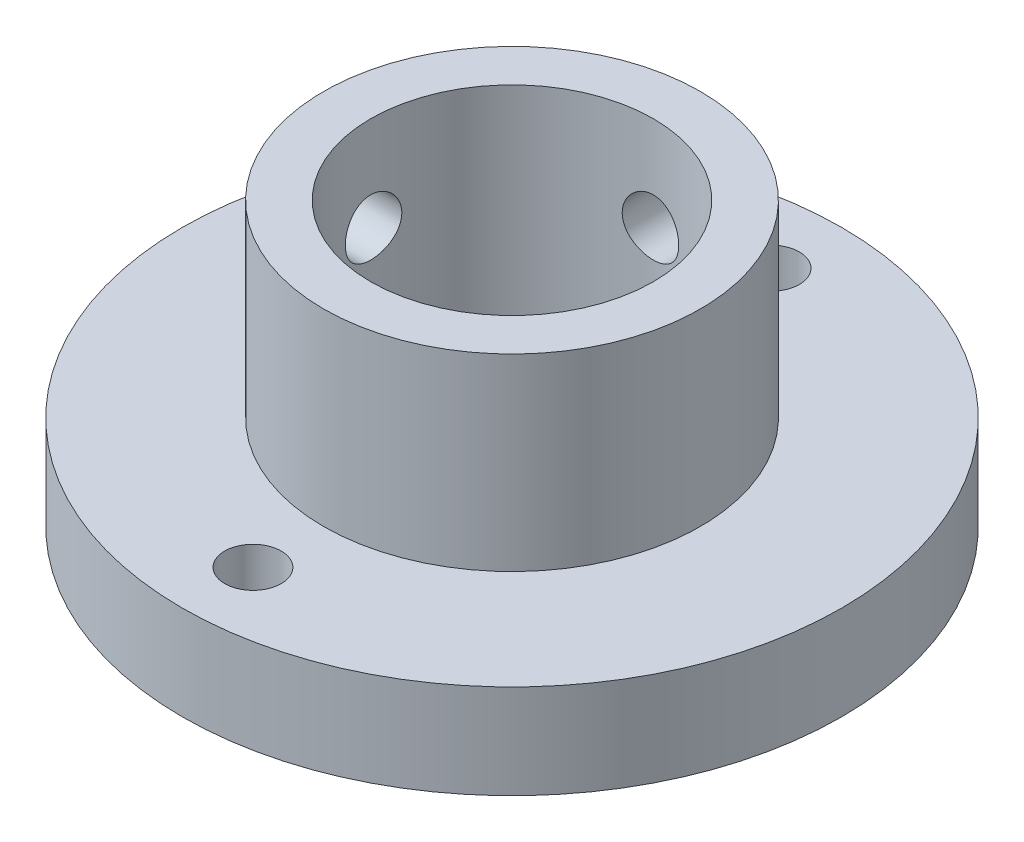
ISO-10303-21;
HEADER;
FILE_DESCRIPTION(('STEP AP214'),'2;1');
FILE_NAME('part.step','',(''),(''),'','','');
FILE_SCHEMA(('AUTOMOTIVE_DESIGN { 1 0 10303 214 1 1 1 1 }'));
ENDSEC;
DATA;
#1=APPLICATION_CONTEXT('core data for automotive mechanical design processes');
#2=APPLICATION_PROTOCOL_DEFINITION('international standard','automotive_design',2000,#1);
#3=PRODUCT_CONTEXT('',#1,'mechanical');
#4=PRODUCT('Part','Part','',(#3));
#5=PRODUCT_RELATED_PRODUCT_CATEGORY('part','',(#4));
#6=PRODUCT_DEFINITION_FORMATION('','',#4);
#7=PRODUCT_DEFINITION_CONTEXT('part definition',#1,'design');
#8=PRODUCT_DEFINITION('design','',#6,#7);
#9=PRODUCT_DEFINITION_SHAPE('','',#8);
#10=(LENGTH_UNIT() NAMED_UNIT(*) SI_UNIT(.MILLI.,.METRE.));
#11=(NAMED_UNIT(*) PLANE_ANGLE_UNIT() SI_UNIT($,.RADIAN.));
#12=(NAMED_UNIT(*) SI_UNIT($,.STERADIAN.) SOLID_ANGLE_UNIT());
#13=UNCERTAINTY_MEASURE_WITH_UNIT(LENGTH_MEASURE(1.E-05),#10,'distance_accuracy_value','');
#14=(GEOMETRIC_REPRESENTATION_CONTEXT(3) GLOBAL_UNCERTAINTY_ASSIGNED_CONTEXT((#13)) GLOBAL_UNIT_ASSIGNED_CONTEXT((#10,
#11,#12)) REPRESENTATION_CONTEXT('',''));
#15=CARTESIAN_POINT('',(0.,0.,0.));
#16=DIRECTION('',(0.,0.,1.));
#17=DIRECTION('',(1.,0.,0.));
#18=AXIS2_PLACEMENT_3D('',#15,#16,#17);
#19=CARTESIAN_POINT('',(0.,5.,0.));
#20=DIRECTION('',(0.,-1.,0.));
#21=DIRECTION('',(0.,0.,-1.));
#22=AXIS2_PLACEMENT_3D('',#19,#20,#21);
#23=CYLINDRICAL_SURFACE('',#22,17.5);
#24=CARTESIAN_POINT('',(0.,5.,0.));
#25=DIRECTION('',(0.,1.,0.));
#26=DIRECTION('',(0.,0.,1.));
#27=AXIS2_PLACEMENT_3D('',#24,#25,#26);
#28=CIRCLE('',#27,17.5);
#29=CARTESIAN_POINT('',(0.,5.,17.5));
#30=VERTEX_POINT('',#29);
#31=EDGE_CURVE('E52',#30,#30,#28,.T.);
#32=ORIENTED_EDGE('',*,*,#31,.F.);
#33=EDGE_LOOP('',(#32));
#34=FACE_BOUND('',#33,.T.);
#35=CARTESIAN_POINT('',(0.,0.,0.));
#36=DIRECTION('',(0.,1.,0.));
#37=DIRECTION('',(0.,0.,1.));
#38=AXIS2_PLACEMENT_3D('',#35,#36,#37);
#39=CIRCLE('',#38,17.5);
#40=CARTESIAN_POINT('',(0.,0.,17.5));
#41=VERTEX_POINT('',#40);
#42=EDGE_CURVE('E58',#41,#41,#39,.T.);
#43=ORIENTED_EDGE('',*,*,#42,.T.);
#44=EDGE_LOOP('',(#43));
#45=FACE_BOUND('',#44,.T.);
#46=ADVANCED_FACE('F39',(#34,#45),#23,.T.);
#47=CARTESIAN_POINT('',(0.,5.,0.));
#48=DIRECTION('',(0.,1.,0.));
#49=DIRECTION('',(0.,0.,1.));
#50=AXIS2_PLACEMENT_3D('',#47,#48,#49);
#51=PLANE('',#50);
#52=CARTESIAN_POINT('',(0.,5.,-13.75));
#53=DIRECTION('',(0.,1.,0.));
#54=DIRECTION('',(0.,0.,1.));
#55=AXIS2_PLACEMENT_3D('',#52,#53,#54);
#56=CIRCLE('',#55,1.5);
#57=CARTESIAN_POINT('',(0.,5.,-12.25));
#58=VERTEX_POINT('',#57);
#59=EDGE_CURVE('E72',#58,#58,#56,.T.);
#60=ORIENTED_EDGE('',*,*,#59,.F.);
#61=EDGE_LOOP('',(#60));
#62=FACE_BOUND('',#61,.T.);
#63=CARTESIAN_POINT('',(0.,5.,13.75));
#64=DIRECTION('',(0.,1.,0.));
#65=DIRECTION('',(0.,0.,1.));
#66=AXIS2_PLACEMENT_3D('',#63,#64,#65);
#67=CIRCLE('',#66,1.5);
#68=CARTESIAN_POINT('',(0.,5.,15.25));
#69=VERTEX_POINT('',#68);
#70=EDGE_CURVE('E107',#69,#69,#67,.T.);
#71=ORIENTED_EDGE('',*,*,#70,.F.);
#72=EDGE_LOOP('',(#71));
#73=FACE_BOUND('',#72,.T.);
#74=CARTESIAN_POINT('',(0.,5.,0.));
#75=DIRECTION('',(0.,1.,0.));
#76=DIRECTION('',(0.,0.,1.));
#77=AXIS2_PLACEMENT_3D('',#74,#75,#76);
#78=CIRCLE('',#77,10.);
#79=CARTESIAN_POINT('',(0.,5.,10.));
#80=VERTEX_POINT('',#79);
#81=EDGE_CURVE('E10',#80,#80,#78,.T.);
#82=ORIENTED_EDGE('',*,*,#81,.F.);
#83=EDGE_LOOP('',(#82));
#84=FACE_BOUND('',#83,.T.);
#85=ORIENTED_EDGE('',*,*,#31,.T.);
#86=EDGE_LOOP('',(#85));
#87=FACE_BOUND('',#86,.T.);
#88=ADVANCED_FACE('F119',(#62,#73,#84,#87),#51,.T.);
#89=CARTESIAN_POINT('',(0.,0.,0.));
#90=DIRECTION('',(0.,1.,0.));
#91=DIRECTION('',(0.,0.,1.));
#92=AXIS2_PLACEMENT_3D('',#89,#90,#91);
#93=PLANE('',#92);
#94=CARTESIAN_POINT('',(0.,0.,-13.75));
#95=DIRECTION('',(0.,1.,0.));
#96=DIRECTION('',(0.,0.,1.));
#97=AXIS2_PLACEMENT_3D('',#94,#95,#96);
#98=CIRCLE('',#97,1.5);
#99=CARTESIAN_POINT('',(0.,0.,-12.25));
#100=VERTEX_POINT('',#99);
#101=EDGE_CURVE('E71',#100,#100,#98,.T.);
#102=ORIENTED_EDGE('',*,*,#101,.T.);
#103=EDGE_LOOP('',(#102));
#104=FACE_BOUND('',#103,.T.);
#105=CARTESIAN_POINT('',(0.,0.,13.75));
#106=DIRECTION('',(0.,1.,0.));
#107=DIRECTION('',(0.,0.,1.));
#108=AXIS2_PLACEMENT_3D('',#105,#106,#107);
#109=CIRCLE('',#108,1.5);
#110=CARTESIAN_POINT('',(0.,0.,15.25));
#111=VERTEX_POINT('',#110);
#112=EDGE_CURVE('E67',#111,#111,#109,.T.);
#113=ORIENTED_EDGE('',*,*,#112,.T.);
#114=EDGE_LOOP('',(#113));
#115=FACE_BOUND('',#114,.T.);
#116=CARTESIAN_POINT('',(0.,0.,0.));
#117=DIRECTION('',(0.,1.,0.));
#118=DIRECTION('',(0.,0.,1.));
#119=AXIS2_PLACEMENT_3D('',#116,#117,#118);
#120=CIRCLE('',#119,7.5);
#121=CARTESIAN_POINT('',(0.,0.,7.5));
#122=VERTEX_POINT('',#121);
#123=EDGE_CURVE('E212',#122,#122,#120,.T.);
#124=ORIENTED_EDGE('',*,*,#123,.T.);
#125=EDGE_LOOP('',(#124));
#126=FACE_BOUND('',#125,.T.);
#127=ORIENTED_EDGE('',*,*,#42,.F.);
#128=EDGE_LOOP('',(#127));
#129=FACE_BOUND('',#128,.T.);
#130=ADVANCED_FACE('F117',(#104,#115,#126,#129),#93,.F.);
#131=CARTESIAN_POINT('',(0.,15.,0.));
#132=DIRECTION('',(0.,-1.,0.));
#133=DIRECTION('',(0.,0.,-1.));
#134=AXIS2_PLACEMENT_3D('',#131,#132,#133);
#135=CYLINDRICAL_SURFACE('',#134,10.);
#136=CARTESIAN_POINT('',(-10.,8.5,0.));
#137=CARTESIAN_POINT('',(-9.99999865771297,8.50000345381524,-0.083751544481642));
#138=CARTESIAN_POINT('',(-9.9989368253704,8.50703800084064,-0.167551685082131));
#139=CARTESIAN_POINT('',(-9.99480315973187,8.53498319998275,-0.332809627994913));
#140=CARTESIAN_POINT('',(-9.99172936938473,8.5559073629449,-0.414265068974229));
#141=CARTESIAN_POINT('',(-9.98391721219526,8.61099250496762,-0.57241808622186));
#142=CARTESIAN_POINT('',(-9.97918010370919,8.64514347950595,-0.649119207826798));
#143=CARTESIAN_POINT('',(-9.96856475911724,8.72568837941686,-0.795690428635253));
#144=CARTESIAN_POINT('',(-9.96268668152773,8.77208060441736,-0.865561474725188));
#145=CARTESIAN_POINT('',(-9.95039170991452,8.87617726493988,-0.997046719562125));
#146=CARTESIAN_POINT('',(-9.94397133890331,8.93395845620821,-1.0585998322255));
#147=CARTESIAN_POINT('',(-9.93134261133238,9.05902768889387,-1.17117490668948));
#148=CARTESIAN_POINT('',(-9.92513426698505,9.12631627677852,-1.22219626272936));
#149=CARTESIAN_POINT('',(-9.91359877458726,9.26890064352249,-1.31249729499943));
#150=CARTESIAN_POINT('',(-9.90827611975031,9.34423424698134,-1.35171787037205));
#151=CARTESIAN_POINT('',(-9.89916211306268,9.50051282064543,-1.41692632171056));
#152=CARTESIAN_POINT('',(-9.89537067775449,9.58145748474389,-1.44291491889163));
#153=CARTESIAN_POINT('',(-9.88978256218673,9.74601804187172,-1.48073198798911));
#154=CARTESIAN_POINT('',(-9.8879711574125,9.82960939340802,-1.49266503640518));
#155=CARTESIAN_POINT('',(-9.88650348970582,9.99762616598728,-1.50235624033932));
#156=CARTESIAN_POINT('',(-9.88684710303147,10.0820515388625,-1.50011520973796));
#157=CARTESIAN_POINT('',(-9.88963718352409,10.2486010801941,-1.48160733250788));
#158=CARTESIAN_POINT('',(-9.89206618761549,10.3307385264848,-1.4654569592775));
#159=CARTESIAN_POINT('',(-9.89872608126367,10.4911243688715,-1.41977117403734));
#160=CARTESIAN_POINT('',(-9.90295702179379,10.5693726548807,-1.39023538337812));
#161=CARTESIAN_POINT('',(-9.91276335545481,10.7201133712829,-1.31849603529736));
#162=CARTESIAN_POINT('',(-9.91834396766526,10.7925819690924,-1.27624314283198));
#163=CARTESIAN_POINT('',(-9.93021707574548,10.9294445957819,-1.18030413128955));
#164=CARTESIAN_POINT('',(-9.93650961832501,10.9938380942694,-1.12661726182478));
#165=CARTESIAN_POINT('',(-9.94917473056209,11.1133976607397,-1.00869493078248));
#166=CARTESIAN_POINT('',(-9.95554747112815,11.1684649902863,-0.944359329642002));
#167=CARTESIAN_POINT('',(-9.96759647648462,11.2670359345073,-0.807307089894187));
#168=CARTESIAN_POINT('',(-9.9732727382251,11.3105394985439,-0.734590414588171));
#169=CARTESIAN_POINT('',(-9.98329515585393,11.3847530864995,-0.582754598213687));
#170=CARTESIAN_POINT('',(-9.98764051925428,11.4154554918403,-0.503631677836781));
#171=CARTESIAN_POINT('',(-9.99450490557069,11.4631093896854,-0.341273182487062));
#172=CARTESIAN_POINT('',(-9.99702405195467,11.4800618118156,-0.258037885952602));
#173=CARTESIAN_POINT('',(-9.99993581133871,11.4996032298167,-0.0906695676436474));
#174=CARTESIAN_POINT('',(-10.0003485209039,11.5023279713793,-0.00655273187047128));
#175=CARTESIAN_POINT('',(-9.99905561015226,11.493696994689,0.160936677662282));
#176=CARTESIAN_POINT('',(-9.99735005541369,11.4823417123319,0.244309274381876));
#177=CARTESIAN_POINT('',(-9.99202468615333,11.4459858998225,0.407532387431407));
#178=CARTESIAN_POINT('',(-9.98841415207984,11.4210515039692,0.487397963079837));
#179=CARTESIAN_POINT('',(-9.97968235658369,11.3583150025382,0.641814958642998));
#180=CARTESIAN_POINT('',(-9.97456102421565,11.3205122926664,0.716366128795099));
#181=CARTESIAN_POINT('',(-9.96332682468686,11.2327937754361,0.85863497929192));
#182=CARTESIAN_POINT('',(-9.95720701626745,11.1827918599872,0.926299009891564));
#183=CARTESIAN_POINT('',(-9.94467863012165,11.0722141883713,1.0523236731777));
#184=CARTESIAN_POINT('',(-9.93827003562867,11.0116378176754,1.1106837647934));
#185=CARTESIAN_POINT('',(-9.92582264304494,10.8810264668235,1.21693784957195));
#186=CARTESIAN_POINT('',(-9.91978736017588,10.8109170748052,1.26474084747421));
#187=CARTESIAN_POINT('',(-9.90883219104903,10.6635839594882,1.34789129270584));
#188=CARTESIAN_POINT('',(-9.90391227465628,10.5863604284785,1.38323907656436));
#189=CARTESIAN_POINT('',(-9.89577033008645,10.4272624663769,1.44033467323943));
#190=CARTESIAN_POINT('',(-9.89254233006438,10.3454055390288,1.46213037141635));
#191=CARTESIAN_POINT('',(-9.88813382297802,10.1791409845649,1.49165549501586));
#192=CARTESIAN_POINT('',(-9.88695317451771,10.0947335340053,1.49938589183066));
#193=CARTESIAN_POINT('',(-9.88677832610841,9.92667093668422,1.5005378666944));
#194=CARTESIAN_POINT('',(-9.88776226333502,9.84301675824308,1.49410252167313));
#195=CARTESIAN_POINT('',(-9.89175820611174,9.67799473667649,1.46741229544379));
#196=CARTESIAN_POINT('',(-9.89477020841118,9.59662688988661,1.44715743638627));
#197=CARTESIAN_POINT('',(-9.90247526112297,9.43852691776568,1.39345373518665));
#198=CARTESIAN_POINT('',(-9.90716703716075,9.36179132956657,1.36001489324314));
#199=CARTESIAN_POINT('',(-9.91770454557702,9.2149963661976,1.28090667642309));
#200=CARTESIAN_POINT('',(-9.92355031702724,9.14493721719636,1.23523688741502));
#201=CARTESIAN_POINT('',(-9.93580743364938,9.01275694202483,1.13244337659164));
#202=CARTESIAN_POINT('',(-9.94222367881967,8.95071866675294,1.07521369039806));
#203=CARTESIAN_POINT('',(-9.95485788826636,8.83707544521218,0.951148841082835));
#204=CARTESIAN_POINT('',(-9.96107580610759,8.78547292742384,0.884311448350942));
#205=CARTESIAN_POINT('',(-9.9726518579052,8.69391232339264,0.742495707543723));
#206=CARTESIAN_POINT('',(-9.9780050712882,8.65401989078526,0.667474576764761));
#207=CARTESIAN_POINT('',(-9.98720028802959,8.58746148324196,0.51175187024872));
#208=CARTESIAN_POINT('',(-9.99104385565757,8.56078180994631,0.431056277096705));
#209=CARTESIAN_POINT('',(-9.99590939261505,8.52745865728989,0.29166572788933));
#210=CARTESIAN_POINT('',(-9.99743549179557,8.51717739846119,0.233831133495279));
#211=CARTESIAN_POINT('',(-9.99948125947896,8.50344690228736,0.117338971600125));
#212=CARTESIAN_POINT('',(-10.0000009404877,8.49999758004746,0.0586814143344171));
#213=CARTESIAN_POINT('',(-10.,8.5,0.));
#214=B_SPLINE_CURVE_WITH_KNOTS('',3,(#136,#137,#138,#139,#140,#141,#142,#143,#144,#145,#146,
#147,#148,#149,#150,#151,#152,#153,#154,#155,#156,#157,#158,#159,#160,#161,#162,#163,#164,#165,
#166,#167,#168,#169,#170,#171,#172,#173,#174,#175,#176,#177,#178,#179,#180,#181,#182,#183,#184,
#185,#186,#187,#188,#189,#190,#191,#192,#193,#194,#195,#196,#197,#198,#199,#200,#201,#202,#203,
#204,#205,#206,#207,#208,#209,#210,#211,#212,#213),.UNSPECIFIED.,.T.,.F.,(4,2,2,2,2,2,2,2,2,2,2,
2,2,2,2,2,2,2,2,2,2,2,2,2,2,2,2,2,2,2,2,2,2,2,2,2,2,2,4),(0.,0.251040205031663,0.50232496292915,
0.753420023583236,1.0044802241976,1.25729416136843,1.5101226357258,1.76419702395375,
2.01825756225506,2.27041564605924,2.52255925098982,2.77261177195746,3.02267136690361,
3.27371383476159,3.52477278308534,3.77834291255408,4.03191415238668,4.28563608984874,
4.53934087193401,4.79062058544255,5.04189251991155,5.29195148965948,5.54202220376273,
5.79391188036907,6.04581620028629,6.29981366584671,6.55380426808832,6.80689223457167,
7.05996272137176,7.31048888261064,7.56101464229563,7.81135073984146,8.06169531466879,
8.3144482996572,8.56726003468733,8.82146323384733,9.07540233261441,9.25129851978808,
9.42719252123291),.UNSPECIFIED.);
#215=CARTESIAN_POINT('',(-10.,8.5,0.));
#216=VERTEX_POINT('',#215);
#217=EDGE_CURVE('E84',#216,#216,#214,.T.);
#218=ORIENTED_EDGE('',*,*,#217,.T.);
#219=EDGE_LOOP('',(#218));
#220=FACE_BOUND('',#219,.T.);
#221=CARTESIAN_POINT('',(0.,11.5,-10.));
#222=CARTESIAN_POINT('',(-0.0837515444816422,11.4999965461848,-9.99999865771297));
#223=CARTESIAN_POINT('',(-0.167551685082132,11.4929619991594,-9.9989368253704));
#224=CARTESIAN_POINT('',(-0.332809627994913,11.4650168000173,-9.99480315973187));
#225=CARTESIAN_POINT('',(-0.414265068974229,11.4440926370551,-9.99172936938473));
#226=CARTESIAN_POINT('',(-0.57241808622186,11.3890074950324,-9.98391721219526));
#227=CARTESIAN_POINT('',(-0.649119207826798,11.3548565204941,-9.97918010370919));
#228=CARTESIAN_POINT('',(-0.795690428635254,11.2743116205831,-9.96856475911724));
#229=CARTESIAN_POINT('',(-0.865561474725188,11.2279193955826,-9.96268668152773));
#230=CARTESIAN_POINT('',(-0.997046719562126,11.1238227350601,-9.95039170991452));
#231=CARTESIAN_POINT('',(-1.0585998322255,11.0660415437918,-9.94397133890331));
#232=CARTESIAN_POINT('',(-1.17117490668948,10.9409723111061,-9.93134261133238));
#233=CARTESIAN_POINT('',(-1.22219626272936,10.8736837232215,-9.92513426698505));
#234=CARTESIAN_POINT('',(-1.31249729499943,10.7310993564775,-9.91359877458726));
#235=CARTESIAN_POINT('',(-1.35171787037205,10.6557657530187,-9.90827611975031));
#236=CARTESIAN_POINT('',(-1.41692632171056,10.4994871793546,-9.89916211306268));
#237=CARTESIAN_POINT('',(-1.44291491889163,10.4185425152561,-9.89537067775449));
#238=CARTESIAN_POINT('',(-1.48073198798911,10.2539819581283,-9.88978256218673));
#239=CARTESIAN_POINT('',(-1.49266503640518,10.170390606592,-9.8879711574125));
#240=CARTESIAN_POINT('',(-1.50235624033932,10.0023738340127,-9.88650348970582));
#241=CARTESIAN_POINT('',(-1.50011520973796,9.91794846113751,-9.88684710303147));
#242=CARTESIAN_POINT('',(-1.48160733250787,9.75139891980586,-9.88963718352409));
#243=CARTESIAN_POINT('',(-1.4654569592775,9.6692614735152,-9.89206618761549));
#244=CARTESIAN_POINT('',(-1.41977117403734,9.50887563112847,-9.89872608126367));
#245=CARTESIAN_POINT('',(-1.39023538337812,9.43062734511926,-9.90295702179379));
#246=CARTESIAN_POINT('',(-1.31849603529736,9.27988662871714,-9.91276335545481));
#247=CARTESIAN_POINT('',(-1.27624314283197,9.20741803090761,-9.91834396766526));
#248=CARTESIAN_POINT('',(-1.18030413128954,9.07055540421807,-9.93021707574548));
#249=CARTESIAN_POINT('',(-1.12661726182478,9.00616190573063,-9.93650961832501));
#250=CARTESIAN_POINT('',(-1.00869493078248,8.88660233926029,-9.9491747305621));
#251=CARTESIAN_POINT('',(-0.944359329642,8.83153500971366,-9.95554747112815));
#252=CARTESIAN_POINT('',(-0.807307089894184,8.73296406549274,-9.96759647648462));
#253=CARTESIAN_POINT('',(-0.734590414588167,8.68946050145611,-9.9732727382251));
#254=CARTESIAN_POINT('',(-0.582754598213682,8.61524691350046,-9.98329515585393));
#255=CARTESIAN_POINT('',(-0.503631677836776,8.58454450815971,-9.98764051925428));
#256=CARTESIAN_POINT('',(-0.341273182487057,8.53689061031463,-9.99450490557069));
#257=CARTESIAN_POINT('',(-0.258037885952598,8.51993818818443,-9.99702405195467));
#258=CARTESIAN_POINT('',(-0.0906695676436436,8.50039677018331,-9.99993581133871));
#259=CARTESIAN_POINT('',(-0.00655273187046751,8.49767202862068,-10.0003485209039));
#260=CARTESIAN_POINT('',(0.160936677662286,8.50630300531103,-9.99905561015226));
#261=CARTESIAN_POINT('',(0.24430927438188,8.5176582876681,-9.99735005541369));
#262=CARTESIAN_POINT('',(0.407532387431412,8.55401410017754,-9.99202468615333));
#263=CARTESIAN_POINT('',(0.487397963079842,8.57894849603085,-9.98841415207984));
#264=CARTESIAN_POINT('',(0.641814958643003,8.64168499746176,-9.97968235658369));
#265=CARTESIAN_POINT('',(0.716366128795103,8.67948770733364,-9.97456102421565));
#266=CARTESIAN_POINT('',(0.858634979291924,8.76720622456387,-9.96332682468686));
#267=CARTESIAN_POINT('',(0.926299009891568,8.81720814001278,-9.95720701626745));
#268=CARTESIAN_POINT('',(1.05232367317771,8.92778581162875,-9.94467863012165));
#269=CARTESIAN_POINT('',(1.11068376479341,8.98836218232465,-9.93827003562867));
#270=CARTESIAN_POINT('',(1.21693784957196,9.1189735331765,-9.92582264304494));
#271=CARTESIAN_POINT('',(1.26474084747421,9.18908292519477,-9.91978736017588));
#272=CARTESIAN_POINT('',(1.34789129270584,9.33641604051178,-9.90883219104903));
#273=CARTESIAN_POINT('',(1.38323907656436,9.41363957152147,-9.90391227465628));
#274=CARTESIAN_POINT('',(1.44033467323944,9.57273753362314,-9.89577033008645));
#275=CARTESIAN_POINT('',(1.46213037141636,9.65459446097125,-9.89254233006438));
#276=CARTESIAN_POINT('',(1.49165549501586,9.82085901543511,-9.88813382297802));
#277=CARTESIAN_POINT('',(1.49938589183067,9.90526646599468,-9.88695317451771));
#278=CARTESIAN_POINT('',(1.5005378666944,10.0733290633158,-9.88677832610841));
#279=CARTESIAN_POINT('',(1.49410252167313,10.1569832417569,-9.88776226333502));
#280=CARTESIAN_POINT('',(1.46741229544379,10.3220052633235,-9.89175820611174));
#281=CARTESIAN_POINT('',(1.44715743638627,10.4033731101134,-9.89477020841118));
#282=CARTESIAN_POINT('',(1.39345373518665,10.5614730822343,-9.90247526112297));
#283=CARTESIAN_POINT('',(1.36001489324314,10.6382086704334,-9.90716703716075));
#284=CARTESIAN_POINT('',(1.28090667642309,10.7850036338024,-9.91770454557702));
#285=CARTESIAN_POINT('',(1.23523688741502,10.8550627828036,-9.92355031702724));
#286=CARTESIAN_POINT('',(1.13244337659164,10.9872430579752,-9.93580743364938));
#287=CARTESIAN_POINT('',(1.07521369039806,11.0492813332471,-9.94222367881967));
#288=CARTESIAN_POINT('',(0.951148841082834,11.1629245547878,-9.95485788826636));
#289=CARTESIAN_POINT('',(0.88431144835094,11.2145270725762,-9.96107580610759));
#290=CARTESIAN_POINT('',(0.742495707543721,11.3060876766074,-9.9726518579052));
#291=CARTESIAN_POINT('',(0.667474576764759,11.3459801092148,-9.9780050712882));
#292=CARTESIAN_POINT('',(0.511751870248717,11.412538516758,-9.98720028802959));
#293=CARTESIAN_POINT('',(0.431056277096703,11.4392181900537,-9.99104385565757));
#294=CARTESIAN_POINT('',(0.291665727889328,11.4725413427101,-9.99590939261505));
#295=CARTESIAN_POINT('',(0.233831133495278,11.4828226015388,-9.99743549179557));
#296=CARTESIAN_POINT('',(0.117338971600125,11.4965530977126,-9.99948125947896));
#297=CARTESIAN_POINT('',(0.0586814143344173,11.5000024199525,-10.0000009404877));
#298=CARTESIAN_POINT('',(0.,11.5,-10.));
#299=B_SPLINE_CURVE_WITH_KNOTS('',3,(#221,#222,#223,#224,#225,#226,#227,#228,#229,#230,#231,
#232,#233,#234,#235,#236,#237,#238,#239,#240,#241,#242,#243,#244,#245,#246,#247,#248,#249,#250,
#251,#252,#253,#254,#255,#256,#257,#258,#259,#260,#261,#262,#263,#264,#265,#266,#267,#268,#269,
#270,#271,#272,#273,#274,#275,#276,#277,#278,#279,#280,#281,#282,#283,#284,#285,#286,#287,#288,
#289,#290,#291,#292,#293,#294,#295,#296,#297,#298),.UNSPECIFIED.,.T.,.F.,(4,2,2,2,2,2,2,2,2,2,2,
2,2,2,2,2,2,2,2,2,2,2,2,2,2,2,2,2,2,2,2,2,2,2,2,2,2,2,4),(0.,0.251040205031663,0.50232496292915,
0.753420023583236,1.0044802241976,1.25729416136843,1.5101226357258,1.76419702395375,
2.01825756225506,2.27041564605924,2.52255925098982,2.77261177195746,3.02267136690361,
3.27371383476159,3.52477278308534,3.77834291255408,4.03191415238668,4.28563608984874,
4.53934087193401,4.79062058544255,5.04189251991155,5.29195148965948,5.54202220376273,
5.79391188036907,6.04581620028629,6.29981366584672,6.55380426808832,6.80689223457168,
7.05996272137176,7.31048888261064,7.56101464229564,7.81135073984146,8.06169531466879,
8.31444829965721,8.56726003468733,8.82146323384733,9.07540233261441,9.25129851978808,
9.4271925212329),.UNSPECIFIED.);
#300=CARTESIAN_POINT('',(0.,11.5,-10.));
#301=VERTEX_POINT('',#300);
#302=EDGE_CURVE('E83',#301,#301,#299,.T.);
#303=ORIENTED_EDGE('',*,*,#302,.T.);
#304=EDGE_LOOP('',(#303));
#305=FACE_BOUND('',#304,.T.);
#306=CARTESIAN_POINT('',(0.,15.,0.));
#307=DIRECTION('',(0.,1.,0.));
#308=DIRECTION('',(0.,0.,1.));
#309=AXIS2_PLACEMENT_3D('',#306,#307,#308);
#310=CIRCLE('',#309,10.);
#311=CARTESIAN_POINT('',(0.,15.,10.));
#312=VERTEX_POINT('',#311);
#313=EDGE_CURVE('E61',#312,#312,#310,.T.);
#314=ORIENTED_EDGE('',*,*,#313,.F.);
#315=EDGE_LOOP('',(#314));
#316=FACE_BOUND('',#315,.T.);
#317=ORIENTED_EDGE('',*,*,#81,.T.);
#318=EDGE_LOOP('',(#317));
#319=FACE_BOUND('',#318,.T.);
#320=ADVANCED_FACE('F112',(#220,#305,#316,#319),#135,.T.);
#321=CARTESIAN_POINT('',(0.,15.,0.));
#322=DIRECTION('',(0.,1.,0.));
#323=DIRECTION('',(0.,0.,1.));
#324=AXIS2_PLACEMENT_3D('',#321,#322,#323);
#325=PLANE('',#324);
#326=CARTESIAN_POINT('',(0.,15.,0.));
#327=DIRECTION('',(0.,1.,0.));
#328=DIRECTION('',(0.,0.,1.));
#329=AXIS2_PLACEMENT_3D('',#326,#327,#328);
#330=CIRCLE('',#329,7.5);
#331=CARTESIAN_POINT('',(0.,15.,7.5));
#332=VERTEX_POINT('',#331);
#333=EDGE_CURVE('E75',#332,#332,#330,.T.);
#334=ORIENTED_EDGE('',*,*,#333,.F.);
#335=EDGE_LOOP('',(#334));
#336=FACE_BOUND('',#335,.T.);
#337=ORIENTED_EDGE('',*,*,#313,.T.);
#338=EDGE_LOOP('',(#337));
#339=FACE_BOUND('',#338,.T.);
#340=ADVANCED_FACE('F116',(#336,#339),#325,.T.);
#341=CARTESIAN_POINT('',(0.,0.,0.));
#342=DIRECTION('',(0.,1.,0.));
#343=DIRECTION('',(0.,0.,1.));
#344=AXIS2_PLACEMENT_3D('',#341,#342,#343);
#345=CYLINDRICAL_SURFACE('',#344,7.5);
#346=CARTESIAN_POINT('',(-7.34846922834953,10.,-1.5));
#347=CARTESIAN_POINT('',(-7.34847088538349,9.91665343676424,-1.49999691881235));
#348=CARTESIAN_POINT('',(-7.34990262402618,9.83326806500025,-1.49302975757707));
#349=CARTESIAN_POINT('',(-7.35546646957746,9.66885624228504,-1.46536842537441));
#350=CARTESIAN_POINT('',(-7.35960073717297,9.58783173304596,-1.44466327060578));
#351=CARTESIAN_POINT('',(-7.37008310582665,9.43054404496876,-1.39019367392958));
#352=CARTESIAN_POINT('',(-7.37642900431582,9.35427621770114,-1.35644222122892));
#353=CARTESIAN_POINT('',(-7.39061699221019,9.20848773295455,-1.27687366150577));
#354=CARTESIAN_POINT('',(-7.398458998102,9.13896669919314,-1.23105722790173));
#355=CARTESIAN_POINT('',(-7.4148794954137,9.00765849421922,-1.12796861348015));
#356=CARTESIAN_POINT('',(-7.42346606755867,8.94598061817404,-1.07055848386998));
#357=CARTESIAN_POINT('',(-7.440337084539,8.83306369963153,-0.946210183531966));
#358=CARTESIAN_POINT('',(-7.44862150816248,8.78182538887421,-0.879271345466976));
#359=CARTESIAN_POINT('',(-7.46404194626342,8.69081797355731,-0.737042033886384));
#360=CARTESIAN_POINT('',(-7.47116732162326,8.65115272927504,-0.661683851508316));
#361=CARTESIAN_POINT('',(-7.48337605325447,8.5850875944278,-0.505206225580908));
#362=CARTESIAN_POINT('',(-7.48845960066179,8.55868646214852,-0.42408732213083));
#363=CARTESIAN_POINT('',(-7.49595481032628,8.52023920957057,-0.259525159917742));
#364=CARTESIAN_POINT('',(-7.4984007943219,8.50800853364349,-0.176126608822222));
#365=CARTESIAN_POINT('',(-7.50046381775405,8.49767357224253,-0.00842785265630487));
#366=CARTESIAN_POINT('',(-7.50008112979138,8.49956792553127,0.0758722647477644));
#367=CARTESIAN_POINT('',(-7.49655652302773,8.51728927032333,0.241713001115383));
#368=CARTESIAN_POINT('',(-7.49345397548757,8.53291746575177,0.323275821447705));
#369=CARTESIAN_POINT('',(-7.48488265739113,8.57734754868834,0.482597439870451));
#370=CARTESIAN_POINT('',(-7.47941379216059,8.60614996328781,0.560356085620693));
#371=CARTESIAN_POINT('',(-7.46665944029938,8.6762950602209,0.71042919480133));
#372=CARTESIAN_POINT('',(-7.45936272262835,8.71771562665733,0.782706261200849));
#373=CARTESIAN_POINT('',(-7.44375704210678,8.8118636158549,0.919357568789633));
#374=CARTESIAN_POINT('',(-7.43544796282833,8.86459233965578,0.9837308992875));
#375=CARTESIAN_POINT('',(-7.41856446546689,8.98095043316271,1.10392714658019));
#376=CARTESIAN_POINT('',(-7.40998794686274,9.04475378009439,1.15958147486045));
#377=CARTESIAN_POINT('',(-7.39367357398141,9.18087466367613,1.25942773976521));
#378=CARTESIAN_POINT('',(-7.38593573556822,9.25319236132479,1.30361945959163));
#379=CARTESIAN_POINT('',(-7.37217071209385,9.40453124773271,1.37934422220282));
#380=CARTESIAN_POINT('',(-7.36614722345324,9.4835664514595,1.41084997166657));
#381=CARTESIAN_POINT('',(-7.35654714481909,9.64595698558599,1.46008551244137));
#382=CARTESIAN_POINT('',(-7.35297023592642,9.72931175142863,1.47781709918496));
#383=CARTESIAN_POINT('',(-7.34873218901742,9.89644728699857,1.49874900905408));
#384=CARTESIAN_POINT('',(-7.34802220585731,9.98019636146551,1.50219278834687));
#385=CARTESIAN_POINT('',(-7.34946728533281,10.1470723347995,1.49510644246611));
#386=CARTESIAN_POINT('',(-7.35162218550582,10.2301992686783,1.48457710968366));
#387=CARTESIAN_POINT('',(-7.35850848742372,10.3926529604384,1.45005331211124));
#388=CARTESIAN_POINT('',(-7.36321498521745,10.4720085145536,1.42618893125895));
#389=CARTESIAN_POINT('',(-7.37465234027497,10.6255949185431,1.36581155296278));
#390=CARTESIAN_POINT('',(-7.38138336429404,10.6998253456536,1.32929751355977));
#391=CARTESIAN_POINT('',(-7.39622108943059,10.8421196649252,1.2441062133234));
#392=CARTESIAN_POINT('',(-7.40434457797355,10.9100905694512,1.19527661697413));
#393=CARTESIAN_POINT('',(-7.42100585739955,11.0369624680014,1.08704335831907));
#394=CARTESIAN_POINT('',(-7.42954369085727,11.0958625273739,1.02763860771681));
#395=CARTESIAN_POINT('',(-7.44623018803823,11.2038438387784,0.898848410246836));
#396=CARTESIAN_POINT('',(-7.45437086563026,11.252760481975,0.829323748394445));
#397=CARTESIAN_POINT('',(-7.4692069144293,11.3382188222494,0.682901844952133));
#398=CARTESIAN_POINT('',(-7.47590234632816,11.3747610390172,0.606004913150261));
#399=CARTESIAN_POINT('',(-7.487059410916,11.43419330762,0.447454021236019));
#400=CARTESIAN_POINT('',(-7.49153368713906,11.4571607773394,0.365830010217117));
#401=CARTESIAN_POINT('',(-7.4977985390649,11.4890368714958,0.199784182019869));
#402=CARTESIAN_POINT('',(-7.49958943799765,11.4979471892135,0.115362703066821));
#403=CARTESIAN_POINT('',(-7.50027810681181,11.5013904714443,-0.0523093408554346));
#404=CARTESIAN_POINT('',(-7.49922567824026,11.4961709206843,-0.135554718212253));
#405=CARTESIAN_POINT('',(-7.49445065340477,11.4720490741783,-0.299956546973462));
#406=CARTESIAN_POINT('',(-7.49072809071528,11.4531469504779,-0.381113024630536));
#407=CARTESIAN_POINT('',(-7.481032475475,11.4023065118625,-0.538879124617644));
#408=CARTESIAN_POINT('',(-7.47506455871866,11.3703979328032,-0.615498664860421));
#409=CARTESIAN_POINT('',(-7.46152083185077,11.2944816380037,-0.762331830278929));
#410=CARTESIAN_POINT('',(-7.45394489468828,11.2504729661444,-0.832544948651117));
#411=CARTESIAN_POINT('',(-7.43786398736791,11.1507709194069,-0.965795835159535));
#412=CARTESIAN_POINT('',(-7.4293460013317,11.0949004954198,-1.02869957417475));
#413=CARTESIAN_POINT('',(-7.41241834355477,10.9734246398563,-1.14432392663527));
#414=CARTESIAN_POINT('',(-7.40400869794476,10.9078169057969,-1.19704212480408));
#415=CARTESIAN_POINT('',(-7.3881501412478,10.7678810249497,-1.29133832918279));
#416=CARTESIAN_POINT('',(-7.38071255446371,10.6934665582593,-1.33279022195961));
#417=CARTESIAN_POINT('',(-7.36777855777287,10.5386008400506,-1.40253607393175));
#418=CARTESIAN_POINT('',(-7.36228038807748,10.4581551419537,-1.43084196896908));
#419=CARTESIAN_POINT('',(-7.3549452169166,10.3146063168448,-1.4680037097813));
#420=CARTESIAN_POINT('',(-7.35253177367824,10.2523218707315,-1.47998084778413));
#421=CARTESIAN_POINT('',(-7.34929317692711,10.1266990681709,-1.49598002694097));
#422=CARTESIAN_POINT('',(-7.34846796865859,10.0633607481326,-1.50000234234439));
#423=CARTESIAN_POINT('',(-7.34846922834953,10.,-1.5));
#424=B_SPLINE_CURVE_WITH_KNOTS('',3,(#346,#347,#348,#349,#350,#351,#352,#353,#354,#355,#356,
#357,#358,#359,#360,#361,#362,#363,#364,#365,#366,#367,#368,#369,#370,#371,#372,#373,#374,#375,
#376,#377,#378,#379,#380,#381,#382,#383,#384,#385,#386,#387,#388,#389,#390,#391,#392,#393,#394,
#395,#396,#397,#398,#399,#400,#401,#402,#403,#404,#405,#406,#407,#408,#409,#410,#411,#412,#413,
#414,#415,#416,#417,#418,#419,#420,#421,#422,#423),.UNSPECIFIED.,.T.,.F.,(4,2,2,2,2,2,2,2,2,2,2,
2,2,2,2,2,2,2,2,2,2,2,2,2,2,2,2,2,2,2,2,2,2,2,2,2,2,2,4),(0.,0.249807695804143,
0.499815358926445,0.749574746910878,0.999320197289796,1.25223378822655,1.50516510053133,
1.76030100656175,2.0154130236984,2.26716373324621,2.51889018174372,2.76703184450306,
3.01518343610625,3.26489886333455,3.51464303655099,3.76874020143725,4.02284217184081,
4.27748794759165,4.53210052524037,4.7823563670689,5.03259801792632,5.28044012674978,
5.52830265531598,5.77939589661782,6.03051499305313,6.28548902600176,6.54045234945157,
6.79394720367975,7.04741152037442,7.29646526122029,7.54551587050135,7.79400025613177,
8.04250428202026,8.29501728038395,8.54759008334671,8.80288347868561,9.05794462633399,
9.24785705455344,9.43776293526322),.UNSPECIFIED.);
#425=CARTESIAN_POINT('',(-7.34846922834953,10.,-1.5));
#426=VERTEX_POINT('',#425);
#427=EDGE_CURVE('E42',#426,#426,#424,.T.);
#428=ORIENTED_EDGE('',*,*,#427,.T.);
#429=EDGE_LOOP('',(#428));
#430=FACE_BOUND('',#429,.T.);
#431=CARTESIAN_POINT('',(1.5,10.,-7.34846922834953));
#432=CARTESIAN_POINT('',(1.49999691881235,9.91665343676424,-7.34847088538349));
#433=CARTESIAN_POINT('',(1.49302975757707,9.83326806500026,-7.34990262402618));
#434=CARTESIAN_POINT('',(1.46536842537441,9.66885624228505,-7.35546646957746));
#435=CARTESIAN_POINT('',(1.44466327060578,9.58783173304597,-7.35960073717297));
#436=CARTESIAN_POINT('',(1.39019367392958,9.43054404496876,-7.37008310582665));
#437=CARTESIAN_POINT('',(1.35644222122892,9.35427621770114,-7.37642900431582));
#438=CARTESIAN_POINT('',(1.27687366150577,9.20848773295455,-7.39061699221019));
#439=CARTESIAN_POINT('',(1.23105722790173,9.13896669919315,-7.398458998102));
#440=CARTESIAN_POINT('',(1.12796861348015,9.00765849421922,-7.4148794954137));
#441=CARTESIAN_POINT('',(1.07055848386998,8.94598061817405,-7.42346606755867));
#442=CARTESIAN_POINT('',(0.946210183531968,8.83306369963153,-7.440337084539));
#443=CARTESIAN_POINT('',(0.879271345466979,8.78182538887422,-7.44862150816248));
#444=CARTESIAN_POINT('',(0.737042033886386,8.69081797355732,-7.46404194626342));
#445=CARTESIAN_POINT('',(0.661683851508319,8.65115272927505,-7.47116732162326));
#446=CARTESIAN_POINT('',(0.505206225580911,8.5850875944278,-7.48337605325447));
#447=CARTESIAN_POINT('',(0.424087322130833,8.55868646214852,-7.48845960066179));
#448=CARTESIAN_POINT('',(0.259525159917744,8.52023920957057,-7.49595481032628));
#449=CARTESIAN_POINT('',(0.176126608822224,8.50800853364349,-7.4984007943219));
#450=CARTESIAN_POINT('',(0.00842785265630727,8.49767357224253,-7.50046381775405));
#451=CARTESIAN_POINT('',(-0.0758722647477621,8.49956792553127,-7.50008112979138));
#452=CARTESIAN_POINT('',(-0.24171300111538,8.51728927032334,-7.49655652302773));
#453=CARTESIAN_POINT('',(-0.323275821447703,8.53291746575178,-7.49345397548757));
#454=CARTESIAN_POINT('',(-0.482597439870449,8.57734754868834,-7.48488265739113));
#455=CARTESIAN_POINT('',(-0.560356085620691,8.60614996328781,-7.47941379216059));
#456=CARTESIAN_POINT('',(-0.710429194801328,8.67629506022091,-7.46665944029938));
#457=CARTESIAN_POINT('',(-0.782706261200847,8.71771562665733,-7.45936272262835));
#458=CARTESIAN_POINT('',(-0.919357568789631,8.8118636158549,-7.44375704210678));
#459=CARTESIAN_POINT('',(-0.983730899287498,8.86459233965578,-7.43544796282833));
#460=CARTESIAN_POINT('',(-1.10392714658018,8.98095043316271,-7.41856446546689));
#461=CARTESIAN_POINT('',(-1.15958147486044,9.04475378009439,-7.40998794686274));
#462=CARTESIAN_POINT('',(-1.25942773976521,9.18087466367613,-7.39367357398141));
#463=CARTESIAN_POINT('',(-1.30361945959162,9.25319236132479,-7.38593573556822));
#464=CARTESIAN_POINT('',(-1.37934422220282,9.40453124773271,-7.37217071209386));
#465=CARTESIAN_POINT('',(-1.41084997166656,9.4835664514595,-7.36614722345324));
#466=CARTESIAN_POINT('',(-1.46008551244137,9.64595698558599,-7.35654714481909));
#467=CARTESIAN_POINT('',(-1.47781709918496,9.72931175142863,-7.35297023592642));
#468=CARTESIAN_POINT('',(-1.49874900905408,9.89644728699857,-7.34873218901742));
#469=CARTESIAN_POINT('',(-1.50219278834687,9.98019636146551,-7.34802220585731));
#470=CARTESIAN_POINT('',(-1.49510644246611,10.1470723347995,-7.34946728533281));
#471=CARTESIAN_POINT('',(-1.48457710968366,10.2301992686783,-7.35162218550582));
#472=CARTESIAN_POINT('',(-1.45005331211123,10.3926529604384,-7.35850848742372));
#473=CARTESIAN_POINT('',(-1.42618893125895,10.4720085145536,-7.36321498521745));
#474=CARTESIAN_POINT('',(-1.36581155296278,10.6255949185431,-7.37465234027497));
#475=CARTESIAN_POINT('',(-1.32929751355976,10.6998253456536,-7.38138336429404));
#476=CARTESIAN_POINT('',(-1.2441062133234,10.8421196649252,-7.39622108943059));
#477=CARTESIAN_POINT('',(-1.19527661697413,10.9100905694512,-7.40434457797355));
#478=CARTESIAN_POINT('',(-1.08704335831907,11.0369624680014,-7.42100585739955));
#479=CARTESIAN_POINT('',(-1.0276386077168,11.0958625273739,-7.42954369085727));
#480=CARTESIAN_POINT('',(-0.898848410246835,11.2038438387784,-7.44623018803823));
#481=CARTESIAN_POINT('',(-0.829323748394444,11.252760481975,-7.45437086563026));
#482=CARTESIAN_POINT('',(-0.682901844952133,11.3382188222494,-7.4692069144293));
#483=CARTESIAN_POINT('',(-0.60600491315026,11.3747610390172,-7.47590234632816));
#484=CARTESIAN_POINT('',(-0.447454021236019,11.43419330762,-7.487059410916));
#485=CARTESIAN_POINT('',(-0.365830010217116,11.4571607773394,-7.49153368713906));
#486=CARTESIAN_POINT('',(-0.199784182019868,11.4890368714958,-7.4977985390649));
#487=CARTESIAN_POINT('',(-0.115362703066821,11.4979471892135,-7.49958943799765));
#488=CARTESIAN_POINT('',(0.0523093408554353,11.5013904714443,-7.50027810681181));
#489=CARTESIAN_POINT('',(0.135554718212254,11.4961709206843,-7.49922567824026));
#490=CARTESIAN_POINT('',(0.299956546973462,11.4720490741783,-7.49445065340477));
#491=CARTESIAN_POINT('',(0.381113024630537,11.4531469504779,-7.49072809071528));
#492=CARTESIAN_POINT('',(0.538879124617644,11.4023065118625,-7.481032475475));
#493=CARTESIAN_POINT('',(0.61549866486042,11.3703979328032,-7.47506455871866));
#494=CARTESIAN_POINT('',(0.762331830278929,11.2944816380037,-7.46152083185077));
#495=CARTESIAN_POINT('',(0.832544948651117,11.2504729661444,-7.45394489468828));
#496=CARTESIAN_POINT('',(0.965795835159536,11.1507709194069,-7.43786398736791));
#497=CARTESIAN_POINT('',(1.02869957417475,11.0949004954198,-7.4293460013317));
#498=CARTESIAN_POINT('',(1.14432392663527,10.9734246398564,-7.41241834355477));
#499=CARTESIAN_POINT('',(1.19704212480408,10.9078169057969,-7.40400869794476));
#500=CARTESIAN_POINT('',(1.29133832918279,10.7678810249497,-7.3881501412478));
#501=CARTESIAN_POINT('',(1.33279022195961,10.6934665582593,-7.38071255446371));
#502=CARTESIAN_POINT('',(1.40253607393175,10.5386008400506,-7.36777855777287));
#503=CARTESIAN_POINT('',(1.43084196896908,10.4581551419537,-7.36228038807748));
#504=CARTESIAN_POINT('',(1.4680037097813,10.3146063168448,-7.3549452169166));
#505=CARTESIAN_POINT('',(1.47998084778413,10.2523218707315,-7.35253177367824));
#506=CARTESIAN_POINT('',(1.49598002694097,10.1266990681709,-7.34929317692711));
#507=CARTESIAN_POINT('',(1.50000234234439,10.0633607481326,-7.34846796865859));
#508=CARTESIAN_POINT('',(1.5,10.,-7.34846922834953));
#509=B_SPLINE_CURVE_WITH_KNOTS('',3,(#431,#432,#433,#434,#435,#436,#437,#438,#439,#440,#441,
#442,#443,#444,#445,#446,#447,#448,#449,#450,#451,#452,#453,#454,#455,#456,#457,#458,#459,#460,
#461,#462,#463,#464,#465,#466,#467,#468,#469,#470,#471,#472,#473,#474,#475,#476,#477,#478,#479,
#480,#481,#482,#483,#484,#485,#486,#487,#488,#489,#490,#491,#492,#493,#494,#495,#496,#497,#498,
#499,#500,#501,#502,#503,#504,#505,#506,#507,#508),.UNSPECIFIED.,.T.,.F.,(4,2,2,2,2,2,2,2,2,2,2,
2,2,2,2,2,2,2,2,2,2,2,2,2,2,2,2,2,2,2,2,2,2,2,2,2,2,2,4),(0.,0.24980769580414,0.499815358926444,
0.749574746910876,0.999320197289796,1.25223378822655,1.50516510053133,1.76030100656175,
2.01541302369839,2.26716373324621,2.51889018174372,2.76703184450306,3.01518343610625,
3.26489886333455,3.51464303655099,3.76874020143725,4.0228421718408,4.27748794759165,
4.53210052524037,4.7823563670689,5.03259801792632,5.28044012674978,5.52830265531598,
5.77939589661782,6.03051499305313,6.28548902600176,6.54045234945157,6.79394720367975,
7.04741152037442,7.29646526122029,7.54551587050135,7.79400025613177,8.04250428202026,
8.29501728038395,8.54759008334671,8.80288347868562,9.05794462633399,9.24785705455344,
9.43776293526322),.UNSPECIFIED.);
#510=CARTESIAN_POINT('',(1.5,10.,-7.34846922834953));
#511=VERTEX_POINT('',#510);
#512=EDGE_CURVE('E76',#511,#511,#509,.T.);
#513=ORIENTED_EDGE('',*,*,#512,.T.);
#514=EDGE_LOOP('',(#513));
#515=FACE_BOUND('',#514,.T.);
#516=ORIENTED_EDGE('',*,*,#123,.F.);
#517=EDGE_LOOP('',(#516));
#518=FACE_BOUND('',#517,.T.);
#519=ORIENTED_EDGE('',*,*,#333,.T.);
#520=EDGE_LOOP('',(#519));
#521=FACE_BOUND('',#520,.T.);
#522=ADVANCED_FACE('F85',(#430,#515,#518,#521),#345,.F.);
#523=CARTESIAN_POINT('',(0.,-5.,13.75));
#524=DIRECTION('',(0.,1.,0.));
#525=DIRECTION('',(0.,0.,1.));
#526=AXIS2_PLACEMENT_3D('',#523,#524,#525);
#527=CYLINDRICAL_SURFACE('',#526,1.5);
#528=ORIENTED_EDGE('',*,*,#70,.T.);
#529=EDGE_LOOP('',(#528));
#530=FACE_BOUND('',#529,.T.);
#531=ORIENTED_EDGE('',*,*,#112,.F.);
#532=EDGE_LOOP('',(#531));
#533=FACE_BOUND('',#532,.T.);
#534=ADVANCED_FACE('F155',(#530,#533),#527,.F.);
#535=CARTESIAN_POINT('',(0.,-5.,-13.75));
#536=DIRECTION('',(0.,1.,0.));
#537=DIRECTION('',(0.,0.,1.));
#538=AXIS2_PLACEMENT_3D('',#535,#536,#537);
#539=CYLINDRICAL_SURFACE('',#538,1.5);
#540=ORIENTED_EDGE('',*,*,#59,.T.);
#541=EDGE_LOOP('',(#540));
#542=FACE_BOUND('',#541,.T.);
#543=ORIENTED_EDGE('',*,*,#101,.F.);
#544=EDGE_LOOP('',(#543));
#545=FACE_BOUND('',#544,.T.);
#546=ADVANCED_FACE('F94',(#542,#545),#539,.F.);
#547=CARTESIAN_POINT('',(0.,10.,-10.));
#548=DIRECTION('',(0.,0.,1.));
#549=DIRECTION('',(1.,0.,0.));
#550=AXIS2_PLACEMENT_3D('',#547,#548,#549);
#551=CYLINDRICAL_SURFACE('',#550,1.5);
#552=ORIENTED_EDGE('',*,*,#512,.F.);
#553=EDGE_LOOP('',(#552));
#554=FACE_BOUND('',#553,.T.);
#555=ORIENTED_EDGE('',*,*,#302,.F.);
#556=EDGE_LOOP('',(#555));
#557=FACE_BOUND('',#556,.T.);
#558=ADVANCED_FACE('F89',(#554,#557),#551,.F.);
#559=CARTESIAN_POINT('',(-10.,10.,0.));
#560=DIRECTION('',(1.,0.,0.));
#561=DIRECTION('',(0.,0.,-1.));
#562=AXIS2_PLACEMENT_3D('',#559,#560,#561);
#563=CYLINDRICAL_SURFACE('',#562,1.5);
#564=ORIENTED_EDGE('',*,*,#427,.F.);
#565=EDGE_LOOP('',(#564));
#566=FACE_BOUND('',#565,.T.);
#567=ORIENTED_EDGE('',*,*,#217,.F.);
#568=EDGE_LOOP('',(#567));
#569=FACE_BOUND('',#568,.T.);
#570=ADVANCED_FACE('F93',(#566,#569),#563,.F.);
#571=CLOSED_SHELL('',(#46,#88,#130,#320,#340,#522,#534,#546,#558,#570));
#572=MANIFOLD_SOLID_BREP('B2',#571);
#573=ADVANCED_BREP_SHAPE_REPRESENTATION('',(#18,#572),#14);
#574=SHAPE_DEFINITION_REPRESENTATION(#9,#573);
ENDSEC;
END-ISO-10303-21;
